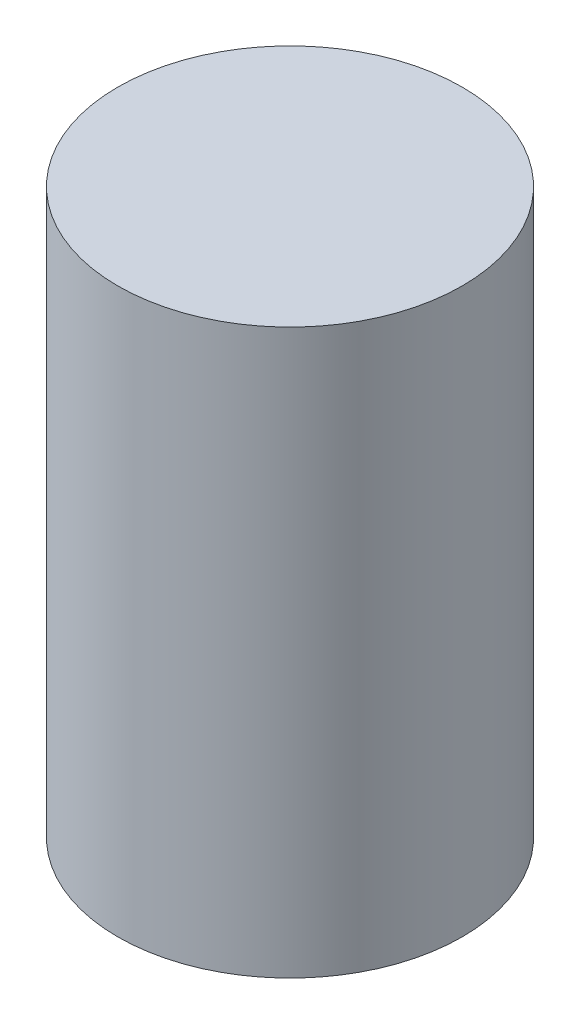
ISO-10303-21;
HEADER;
FILE_DESCRIPTION(('STEP AP214'),'2;1');
FILE_NAME('part.step','',(''),(''),'','','');
FILE_SCHEMA(('AUTOMOTIVE_DESIGN { 1 0 10303 214 1 1 1 1 }'));
ENDSEC;
DATA;
#1=APPLICATION_CONTEXT('core data for automotive mechanical design processes');
#2=APPLICATION_PROTOCOL_DEFINITION('international standard','automotive_design',2000,#1);
#3=PRODUCT_CONTEXT('',#1,'mechanical');
#4=PRODUCT('Part','Part','',(#3));
#5=PRODUCT_RELATED_PRODUCT_CATEGORY('part','',(#4));
#6=PRODUCT_DEFINITION_FORMATION('','',#4);
#7=PRODUCT_DEFINITION_CONTEXT('part definition',#1,'design');
#8=PRODUCT_DEFINITION('design','',#6,#7);
#9=PRODUCT_DEFINITION_SHAPE('','',#8);
#10=(LENGTH_UNIT() NAMED_UNIT(*) SI_UNIT(.MILLI.,.METRE.));
#11=(NAMED_UNIT(*) PLANE_ANGLE_UNIT() SI_UNIT($,.RADIAN.));
#12=(NAMED_UNIT(*) SI_UNIT($,.STERADIAN.) SOLID_ANGLE_UNIT());
#13=UNCERTAINTY_MEASURE_WITH_UNIT(LENGTH_MEASURE(1.E-05),#10,'distance_accuracy_value','');
#14=(GEOMETRIC_REPRESENTATION_CONTEXT(3) GLOBAL_UNCERTAINTY_ASSIGNED_CONTEXT((#13)) GLOBAL_UNIT_ASSIGNED_CONTEXT((#10,
#11,#12)) REPRESENTATION_CONTEXT('',''));
#15=CARTESIAN_POINT('',(0.,0.,0.));
#16=DIRECTION('',(0.,0.,1.));
#17=DIRECTION('',(1.,0.,0.));
#18=AXIS2_PLACEMENT_3D('',#15,#16,#17);
#19=CARTESIAN_POINT('',(266.6111,-155.976700000003,163.321799999999));
#20=DIRECTION('',(0.,1.,-1.89451696004684E-13));
#21=DIRECTION('',(0.,1.89451696004684E-13,1.));
#22=AXIS2_PLACEMENT_3D('',#19,#20,#21);
#23=PLANE('',#22);
#24=CARTESIAN_POINT('',(266.6111,-155.976700000003,163.321799999999));
#25=DIRECTION('',(0.,1.,-1.89451696004684E-13));
#26=DIRECTION('',(0.,1.89451696004684E-13,1.));
#27=AXIS2_PLACEMENT_3D('',#24,#25,#26);
#28=CIRCLE('',#27,4.69900000000001);
#29=CARTESIAN_POINT('',(266.6111,-155.976700000002,168.020799999999));
#30=VERTEX_POINT('',#29);
#31=EDGE_CURVE('E44',#30,#30,#28,.T.);
#32=ORIENTED_EDGE('',*,*,#31,.F.);
#33=EDGE_LOOP('',(#32));
#34=FACE_BOUND('',#33,.T.);
#35=ADVANCED_FACE('F38',(#34),#23,.F.);
#36=CARTESIAN_POINT('',(266.6111,-140.593699999997,163.321799999996));
#37=DIRECTION('',(0.,1.,-1.89451696004684E-13));
#38=DIRECTION('',(0.,1.89451696004684E-13,1.));
#39=AXIS2_PLACEMENT_3D('',#36,#37,#38);
#40=PLANE('',#39);
#41=CARTESIAN_POINT('',(266.6111,-140.593699999997,163.321799999996));
#42=DIRECTION('',(0.,1.,-1.89451696004684E-13));
#43=DIRECTION('',(0.,1.89451696004684E-13,1.));
#44=AXIS2_PLACEMENT_3D('',#41,#42,#43);
#45=CIRCLE('',#44,4.69900000000001);
#46=CARTESIAN_POINT('',(266.6111,-140.593699999997,168.020799999996));
#47=VERTEX_POINT('',#46);
#48=EDGE_CURVE('E11',#47,#47,#45,.T.);
#49=ORIENTED_EDGE('',*,*,#48,.T.);
#50=EDGE_LOOP('',(#49));
#51=FACE_BOUND('',#50,.T.);
#52=ADVANCED_FACE('F53',(#51),#40,.T.);
#53=CARTESIAN_POINT('',(266.6111,-155.976700000003,163.321799999999));
#54=DIRECTION('',(0.,1.,-1.87647394137972E-13));
#55=DIRECTION('',(0.,1.87647394137972E-13,1.));
#56=AXIS2_PLACEMENT_3D('',#53,#54,#55);
#57=CYLINDRICAL_SURFACE('',#56,4.69900000000001);
#58=ORIENTED_EDGE('',*,*,#48,.F.);
#59=EDGE_LOOP('',(#58));
#60=FACE_BOUND('',#59,.T.);
#61=ORIENTED_EDGE('',*,*,#31,.T.);
#62=EDGE_LOOP('',(#61));
#63=FACE_BOUND('',#62,.T.);
#64=ADVANCED_FACE('F50',(#60,#63),#57,.T.);
#65=CLOSED_SHELL('',(#35,#52,#64));
#66=MANIFOLD_SOLID_BREP('B2',#65);
#67=ADVANCED_BREP_SHAPE_REPRESENTATION('',(#18,#66),#14);
#68=SHAPE_DEFINITION_REPRESENTATION(#9,#67);
ENDSEC;
END-ISO-10303-21;
